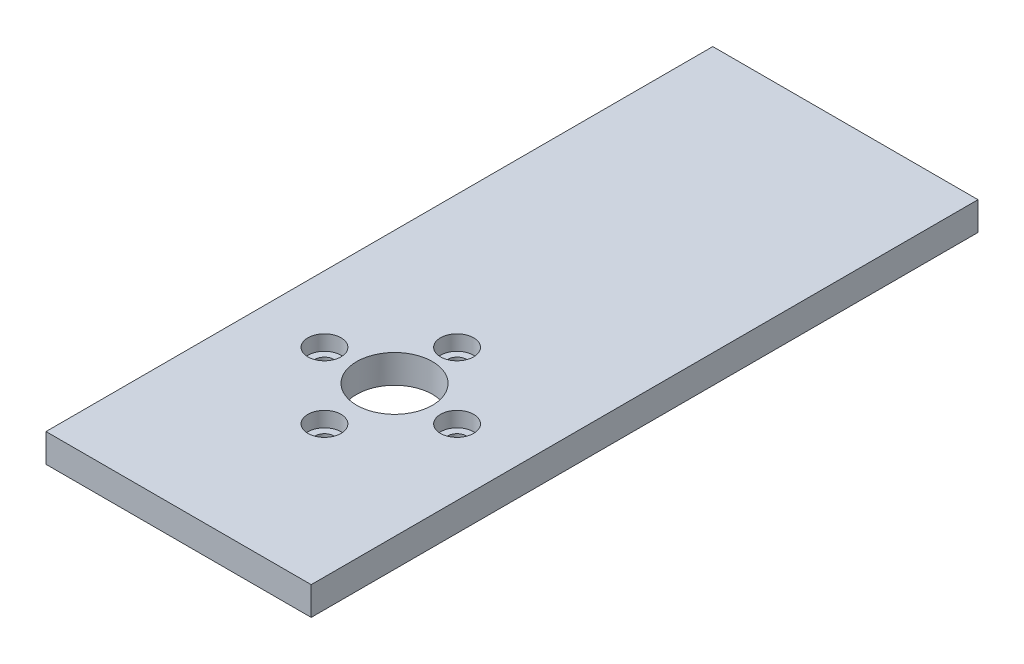
ISO-10303-21;
HEADER;
FILE_DESCRIPTION(('STEP AP214'),'2;1');
FILE_NAME('part.step','',(''),(''),'','','');
FILE_SCHEMA(('AUTOMOTIVE_DESIGN { 1 0 10303 214 1 1 1 1 }'));
ENDSEC;
DATA;
#1=APPLICATION_CONTEXT('core data for automotive mechanical design processes');
#2=APPLICATION_PROTOCOL_DEFINITION('international standard','automotive_design',2000,#1);
#3=PRODUCT_CONTEXT('',#1,'mechanical');
#4=PRODUCT('Part','Part','',(#3));
#5=PRODUCT_RELATED_PRODUCT_CATEGORY('part','',(#4));
#6=PRODUCT_DEFINITION_FORMATION('','',#4);
#7=PRODUCT_DEFINITION_CONTEXT('part definition',#1,'design');
#8=PRODUCT_DEFINITION('design','',#6,#7);
#9=PRODUCT_DEFINITION_SHAPE('','',#8);
#10=(LENGTH_UNIT() NAMED_UNIT(*) SI_UNIT(.MILLI.,.METRE.));
#11=(NAMED_UNIT(*) PLANE_ANGLE_UNIT() SI_UNIT($,.RADIAN.));
#12=(NAMED_UNIT(*) SI_UNIT($,.STERADIAN.) SOLID_ANGLE_UNIT());
#13=UNCERTAINTY_MEASURE_WITH_UNIT(LENGTH_MEASURE(1.E-05),#10,'distance_accuracy_value','');
#14=(GEOMETRIC_REPRESENTATION_CONTEXT(3) GLOBAL_UNCERTAINTY_ASSIGNED_CONTEXT((#13)) GLOBAL_UNIT_ASSIGNED_CONTEXT((#10,
#11,#12)) REPRESENTATION_CONTEXT('',''));
#15=CARTESIAN_POINT('',(0.,0.,0.));
#16=DIRECTION('',(0.,0.,1.));
#17=DIRECTION('',(1.,0.,0.));
#18=AXIS2_PLACEMENT_3D('',#15,#16,#17);
#19=CARTESIAN_POINT('',(7.0000000000001,-7.,12.7999999999978));
#20=DIRECTION('',(0.,1.,0.));
#21=DIRECTION('',(0.,0.,1.));
#22=AXIS2_PLACEMENT_3D('',#19,#20,#21);
#23=CYLINDRICAL_SURFACE('',#22,1.);
#24=CARTESIAN_POINT('',(7.0000000000001,0.,12.7999999999978));
#25=DIRECTION('',(0.,-1.,0.));
#26=DIRECTION('',(0.,0.,-1.));
#27=AXIS2_PLACEMENT_3D('',#24,#25,#26);
#28=CIRCLE('',#27,1.);
#29=CARTESIAN_POINT('',(7.0000000000001,0.,11.7999999999978));
#30=VERTEX_POINT('',#29);
#31=EDGE_CURVE('E115',#30,#30,#28,.T.);
#32=ORIENTED_EDGE('',*,*,#31,.T.);
#33=EDGE_LOOP('',(#32));
#34=FACE_BOUND('',#33,.T.);
#35=CARTESIAN_POINT('',(7.0000000000001,1.4,12.7999999999978));
#36=DIRECTION('',(0.,1.,0.));
#37=DIRECTION('',(0.,0.,1.));
#38=AXIS2_PLACEMENT_3D('',#35,#36,#37);
#39=CIRCLE('',#38,1.);
#40=CARTESIAN_POINT('',(7.0000000000001,1.4,13.7999999999978));
#41=VERTEX_POINT('',#40);
#42=EDGE_CURVE('E41',#41,#41,#39,.F.);
#43=ORIENTED_EDGE('',*,*,#42,.F.);
#44=EDGE_LOOP('',(#43));
#45=FACE_BOUND('',#44,.T.);
#46=ADVANCED_FACE('F37',(#34,#45),#23,.F.);
#47=CARTESIAN_POINT('',(-6.9999999999999,-7.,12.7999999999979));
#48=DIRECTION('',(0.,1.,0.));
#49=DIRECTION('',(0.,0.,1.));
#50=AXIS2_PLACEMENT_3D('',#47,#48,#49);
#51=CYLINDRICAL_SURFACE('',#50,1.);
#52=CARTESIAN_POINT('',(-6.9999999999999,0.,12.7999999999979));
#53=DIRECTION('',(0.,-1.,0.));
#54=DIRECTION('',(0.,0.,-1.));
#55=AXIS2_PLACEMENT_3D('',#52,#53,#54);
#56=CIRCLE('',#55,1.);
#57=CARTESIAN_POINT('',(-6.9999999999999,0.,11.7999999999979));
#58=VERTEX_POINT('',#57);
#59=EDGE_CURVE('E121',#58,#58,#56,.T.);
#60=ORIENTED_EDGE('',*,*,#59,.T.);
#61=EDGE_LOOP('',(#60));
#62=FACE_BOUND('',#61,.T.);
#63=CARTESIAN_POINT('',(-6.9999999999999,1.4,12.7999999999979));
#64=DIRECTION('',(0.,1.,0.));
#65=DIRECTION('',(0.,0.,1.));
#66=AXIS2_PLACEMENT_3D('',#63,#64,#65);
#67=CIRCLE('',#66,1.);
#68=CARTESIAN_POINT('',(-6.9999999999999,1.4,13.7999999999979));
#69=VERTEX_POINT('',#68);
#70=EDGE_CURVE('E136',#69,#69,#67,.F.);
#71=ORIENTED_EDGE('',*,*,#70,.F.);
#72=EDGE_LOOP('',(#71));
#73=FACE_BOUND('',#72,.T.);
#74=ADVANCED_FACE('F182',(#62,#73),#51,.F.);
#75=CARTESIAN_POINT('',(0.,-7.,5.79999999999792));
#76=DIRECTION('',(0.,1.,0.));
#77=DIRECTION('',(0.,0.,1.));
#78=AXIS2_PLACEMENT_3D('',#75,#76,#77);
#79=CYLINDRICAL_SURFACE('',#78,1.);
#80=CARTESIAN_POINT('',(0.,0.,5.79999999999792));
#81=DIRECTION('',(0.,-1.,0.));
#82=DIRECTION('',(0.,0.,-1.));
#83=AXIS2_PLACEMENT_3D('',#80,#81,#82);
#84=CIRCLE('',#83,1.);
#85=CARTESIAN_POINT('',(0.,0.,4.79999999999792));
#86=VERTEX_POINT('',#85);
#87=EDGE_CURVE('E107',#86,#86,#84,.T.);
#88=ORIENTED_EDGE('',*,*,#87,.T.);
#89=EDGE_LOOP('',(#88));
#90=FACE_BOUND('',#89,.T.);
#91=CARTESIAN_POINT('',(0.,1.4,5.79999999999792));
#92=DIRECTION('',(0.,1.,0.));
#93=DIRECTION('',(0.,0.,1.));
#94=AXIS2_PLACEMENT_3D('',#91,#92,#93);
#95=CIRCLE('',#94,1.);
#96=CARTESIAN_POINT('',(0.,1.4,6.79999999999792));
#97=VERTEX_POINT('',#96);
#98=EDGE_CURVE('E132',#97,#97,#95,.F.);
#99=ORIENTED_EDGE('',*,*,#98,.F.);
#100=EDGE_LOOP('',(#99));
#101=FACE_BOUND('',#100,.T.);
#102=ADVANCED_FACE('F188',(#90,#101),#79,.F.);
#103=CARTESIAN_POINT('',(1.45764745514838E-13,-7.,19.7999999999979));
#104=DIRECTION('',(0.,1.,0.));
#105=DIRECTION('',(0.,0.,1.));
#106=AXIS2_PLACEMENT_3D('',#103,#104,#105);
#107=CYLINDRICAL_SURFACE('',#106,1.);
#108=CARTESIAN_POINT('',(1.45764745514838E-13,0.,19.7999999999979));
#109=DIRECTION('',(0.,-1.,0.));
#110=DIRECTION('',(0.,0.,-1.));
#111=AXIS2_PLACEMENT_3D('',#108,#109,#110);
#112=CIRCLE('',#111,1.);
#113=CARTESIAN_POINT('',(1.45764745514838E-13,0.,18.7999999999979));
#114=VERTEX_POINT('',#113);
#115=EDGE_CURVE('E118',#114,#114,#112,.T.);
#116=ORIENTED_EDGE('',*,*,#115,.T.);
#117=EDGE_LOOP('',(#116));
#118=FACE_BOUND('',#117,.T.);
#119=CARTESIAN_POINT('',(1.45764745514838E-13,1.4,19.7999999999979));
#120=DIRECTION('',(0.,1.,0.));
#121=DIRECTION('',(0.,0.,1.));
#122=AXIS2_PLACEMENT_3D('',#119,#120,#121);
#123=CIRCLE('',#122,1.);
#124=CARTESIAN_POINT('',(1.45764745514838E-13,1.4,20.7999999999979));
#125=VERTEX_POINT('',#124);
#126=EDGE_CURVE('E128',#125,#125,#123,.F.);
#127=ORIENTED_EDGE('',*,*,#126,.F.);
#128=EDGE_LOOP('',(#127));
#129=FACE_BOUND('',#128,.T.);
#130=ADVANCED_FACE('F193',(#118,#129),#107,.F.);
#131=CARTESIAN_POINT('',(14.,3.,35.2));
#132=DIRECTION('',(-1.,0.,0.));
#133=DIRECTION('',(0.,0.,1.));
#134=AXIS2_PLACEMENT_3D('',#131,#132,#133);
#135=PLANE('',#134);
#136=DIRECTION('',(0.,0.,-1.));
#137=VECTOR('',#136,1.);
#138=CARTESIAN_POINT('',(14.,0.,35.2));
#139=LINE('',#138,#137);
#140=CARTESIAN_POINT('',(14.,0.,35.2));
#141=VERTEX_POINT('',#140);
#142=CARTESIAN_POINT('',(14.,0.,-35.2));
#143=VERTEX_POINT('',#142);
#144=EDGE_CURVE('E104',#141,#143,#139,.T.);
#145=ORIENTED_EDGE('',*,*,#144,.T.);
#146=DIRECTION('',(0.,-1.,0.));
#147=VECTOR('',#146,1.);
#148=CARTESIAN_POINT('',(14.,3.,-35.2));
#149=LINE('',#148,#147);
#150=CARTESIAN_POINT('',(14.,3.,-35.2));
#151=VERTEX_POINT('',#150);
#152=EDGE_CURVE('E11',#151,#143,#149,.T.);
#153=ORIENTED_EDGE('',*,*,#152,.F.);
#154=DIRECTION('',(0.,0.,-1.));
#155=VECTOR('',#154,1.);
#156=CARTESIAN_POINT('',(14.,3.,35.2));
#157=LINE('',#156,#155);
#158=CARTESIAN_POINT('',(14.,3.,35.2));
#159=VERTEX_POINT('',#158);
#160=EDGE_CURVE('E91',#159,#151,#157,.T.);
#161=ORIENTED_EDGE('',*,*,#160,.F.);
#162=DIRECTION('',(0.,-1.,0.));
#163=VECTOR('',#162,1.);
#164=CARTESIAN_POINT('',(14.,3.,35.2));
#165=LINE('',#164,#163);
#166=EDGE_CURVE('E100',#159,#141,#165,.T.);
#167=ORIENTED_EDGE('',*,*,#166,.T.);
#168=EDGE_LOOP('',(#145,#153,#161,#167));
#169=FACE_BOUND('',#168,.T.);
#170=ADVANCED_FACE('F39',(#169),#135,.F.);
#171=CARTESIAN_POINT('',(-14.,3.,-35.2));
#172=DIRECTION('',(0.,0.,1.));
#173=DIRECTION('',(1.,0.,0.));
#174=AXIS2_PLACEMENT_3D('',#171,#172,#173);
#175=PLANE('',#174);
#176=DIRECTION('',(-1.,0.,0.));
#177=VECTOR('',#176,1.);
#178=CARTESIAN_POINT('',(-14.,0.,-35.2));
#179=LINE('',#178,#177);
#180=CARTESIAN_POINT('',(-14.,0.,-35.2));
#181=VERTEX_POINT('',#180);
#182=EDGE_CURVE('E95',#143,#181,#179,.T.);
#183=ORIENTED_EDGE('',*,*,#182,.T.);
#184=DIRECTION('',(0.,-1.,0.));
#185=VECTOR('',#184,1.);
#186=CARTESIAN_POINT('',(-14.,3.,-35.2));
#187=LINE('',#186,#185);
#188=CARTESIAN_POINT('',(-14.,3.,-35.2));
#189=VERTEX_POINT('',#188);
#190=EDGE_CURVE('E47',#189,#181,#187,.T.);
#191=ORIENTED_EDGE('',*,*,#190,.F.);
#192=DIRECTION('',(-1.,0.,0.));
#193=VECTOR('',#192,1.);
#194=CARTESIAN_POINT('',(-14.,3.,-35.2));
#195=LINE('',#194,#193);
#196=EDGE_CURVE('E86',#151,#189,#195,.T.);
#197=ORIENTED_EDGE('',*,*,#196,.F.);
#198=ORIENTED_EDGE('',*,*,#152,.T.);
#199=EDGE_LOOP('',(#183,#191,#197,#198));
#200=FACE_BOUND('',#199,.T.);
#201=ADVANCED_FACE('F94',(#200),#175,.F.);
#202=CARTESIAN_POINT('',(-14.,3.,35.2));
#203=DIRECTION('',(1.,0.,0.));
#204=DIRECTION('',(0.,0.,-1.));
#205=AXIS2_PLACEMENT_3D('',#202,#203,#204);
#206=PLANE('',#205);
#207=DIRECTION('',(0.,0.,1.));
#208=VECTOR('',#207,1.);
#209=CARTESIAN_POINT('',(-14.,0.,35.2));
#210=LINE('',#209,#208);
#211=CARTESIAN_POINT('',(-14.,0.,35.2));
#212=VERTEX_POINT('',#211);
#213=EDGE_CURVE('E73',#181,#212,#210,.T.);
#214=ORIENTED_EDGE('',*,*,#213,.T.);
#215=DIRECTION('',(0.,-1.,0.));
#216=VECTOR('',#215,1.);
#217=CARTESIAN_POINT('',(-14.,3.,35.2));
#218=LINE('',#217,#216);
#219=CARTESIAN_POINT('',(-14.,3.,35.2));
#220=VERTEX_POINT('',#219);
#221=EDGE_CURVE('E96',#220,#212,#218,.T.);
#222=ORIENTED_EDGE('',*,*,#221,.F.);
#223=DIRECTION('',(0.,0.,1.));
#224=VECTOR('',#223,1.);
#225=CARTESIAN_POINT('',(-14.,3.,35.2));
#226=LINE('',#225,#224);
#227=EDGE_CURVE('E89',#189,#220,#226,.T.);
#228=ORIENTED_EDGE('',*,*,#227,.F.);
#229=ORIENTED_EDGE('',*,*,#190,.T.);
#230=EDGE_LOOP('',(#214,#222,#228,#229));
#231=FACE_BOUND('',#230,.T.);
#232=ADVANCED_FACE('F98',(#231),#206,.F.);
#233=CARTESIAN_POINT('',(-14.,3.,35.2));
#234=DIRECTION('',(0.,0.,-1.));
#235=DIRECTION('',(-1.,0.,0.));
#236=AXIS2_PLACEMENT_3D('',#233,#234,#235);
#237=PLANE('',#236);
#238=DIRECTION('',(1.,0.,0.));
#239=VECTOR('',#238,1.);
#240=CARTESIAN_POINT('',(-14.,0.,35.2));
#241=LINE('',#240,#239);
#242=EDGE_CURVE('E79',#212,#141,#241,.T.);
#243=ORIENTED_EDGE('',*,*,#242,.T.);
#244=ORIENTED_EDGE('',*,*,#166,.F.);
#245=DIRECTION('',(1.,0.,0.));
#246=VECTOR('',#245,1.);
#247=CARTESIAN_POINT('',(-14.,3.,35.2));
#248=LINE('',#247,#246);
#249=EDGE_CURVE('E56',#220,#159,#248,.T.);
#250=ORIENTED_EDGE('',*,*,#249,.F.);
#251=ORIENTED_EDGE('',*,*,#221,.T.);
#252=EDGE_LOOP('',(#243,#244,#250,#251));
#253=FACE_BOUND('',#252,.T.);
#254=ADVANCED_FACE('F168',(#253),#237,.F.);
#255=CARTESIAN_POINT('',(0.,3.,0.));
#256=DIRECTION('',(0.,-1.,0.));
#257=DIRECTION('',(0.,0.,-1.));
#258=AXIS2_PLACEMENT_3D('',#255,#256,#257);
#259=PLANE('',#258);
#260=CARTESIAN_POINT('',(7.0000000000001,3.,12.7999999999978));
#261=DIRECTION('',(0.,1.,0.));
#262=DIRECTION('',(0.,0.,1.));
#263=AXIS2_PLACEMENT_3D('',#260,#261,#262);
#264=CIRCLE('',#263,1.75);
#265=CARTESIAN_POINT('',(7.0000000000001,3.,14.5499999999978));
#266=VERTEX_POINT('',#265);
#267=EDGE_CURVE('E152',#266,#266,#264,.T.);
#268=ORIENTED_EDGE('',*,*,#267,.F.);
#269=EDGE_LOOP('',(#268));
#270=FACE_BOUND('',#269,.T.);
#271=CARTESIAN_POINT('',(-6.9999999999999,3.,12.7999999999979));
#272=DIRECTION('',(0.,1.,0.));
#273=DIRECTION('',(0.,0.,1.));
#274=AXIS2_PLACEMENT_3D('',#271,#272,#273);
#275=CIRCLE('',#274,1.75);
#276=CARTESIAN_POINT('',(-6.9999999999999,3.,14.5499999999979));
#277=VERTEX_POINT('',#276);
#278=EDGE_CURVE('E145',#277,#277,#275,.T.);
#279=ORIENTED_EDGE('',*,*,#278,.F.);
#280=EDGE_LOOP('',(#279));
#281=FACE_BOUND('',#280,.T.);
#282=CARTESIAN_POINT('',(0.,3.,5.79999999999792));
#283=DIRECTION('',(0.,1.,0.));
#284=DIRECTION('',(0.,0.,1.));
#285=AXIS2_PLACEMENT_3D('',#282,#283,#284);
#286=CIRCLE('',#285,1.75);
#287=CARTESIAN_POINT('',(0.,3.,7.54999999999792));
#288=VERTEX_POINT('',#287);
#289=EDGE_CURVE('E138',#288,#288,#286,.T.);
#290=ORIENTED_EDGE('',*,*,#289,.F.);
#291=EDGE_LOOP('',(#290));
#292=FACE_BOUND('',#291,.T.);
#293=CARTESIAN_POINT('',(1.45764745514838E-13,3.,19.7999999999979));
#294=DIRECTION('',(0.,1.,0.));
#295=DIRECTION('',(0.,0.,1.));
#296=AXIS2_PLACEMENT_3D('',#293,#294,#295);
#297=CIRCLE('',#296,1.75);
#298=CARTESIAN_POINT('',(1.45764745514838E-13,3.,21.5499999999979));
#299=VERTEX_POINT('',#298);
#300=EDGE_CURVE('E134',#299,#299,#297,.T.);
#301=ORIENTED_EDGE('',*,*,#300,.F.);
#302=EDGE_LOOP('',(#301));
#303=FACE_BOUND('',#302,.T.);
#304=CARTESIAN_POINT('',(0.,3.,12.3999999999985));
#305=DIRECTION('',(0.,1.,0.));
#306=DIRECTION('',(0.,0.,1.));
#307=AXIS2_PLACEMENT_3D('',#304,#305,#306);
#308=CIRCLE('',#307,4.);
#309=CARTESIAN_POINT('',(0.,3.,16.3999999999985));
#310=VERTEX_POINT('',#309);
#311=EDGE_CURVE('E127',#310,#310,#308,.T.);
#312=ORIENTED_EDGE('',*,*,#311,.F.);
#313=EDGE_LOOP('',(#312));
#314=FACE_BOUND('',#313,.T.);
#315=ORIENTED_EDGE('',*,*,#160,.T.);
#316=ORIENTED_EDGE('',*,*,#196,.T.);
#317=ORIENTED_EDGE('',*,*,#227,.T.);
#318=ORIENTED_EDGE('',*,*,#249,.T.);
#319=EDGE_LOOP('',(#315,#316,#317,#318));
#320=FACE_BOUND('',#319,.T.);
#321=ADVANCED_FACE('F87',(#270,#281,#292,#303,#314,#320),#259,.F.);
#322=CARTESIAN_POINT('',(0.,0.,0.));
#323=DIRECTION('',(0.,-1.,0.));
#324=DIRECTION('',(0.,0.,-1.));
#325=AXIS2_PLACEMENT_3D('',#322,#323,#324);
#326=PLANE('',#325);
#327=CARTESIAN_POINT('',(0.,0.,12.3999999999985));
#328=DIRECTION('',(0.,-1.,0.));
#329=DIRECTION('',(0.,0.,-1.));
#330=AXIS2_PLACEMENT_3D('',#327,#328,#329);
#331=CIRCLE('',#330,4.);
#332=CARTESIAN_POINT('',(0.,0.,8.39999999999852));
#333=VERTEX_POINT('',#332);
#334=EDGE_CURVE('E124',#333,#333,#331,.T.);
#335=ORIENTED_EDGE('',*,*,#334,.F.);
#336=EDGE_LOOP('',(#335));
#337=FACE_BOUND('',#336,.T.);
#338=ORIENTED_EDGE('',*,*,#59,.F.);
#339=EDGE_LOOP('',(#338));
#340=FACE_BOUND('',#339,.T.);
#341=ORIENTED_EDGE('',*,*,#115,.F.);
#342=EDGE_LOOP('',(#341));
#343=FACE_BOUND('',#342,.T.);
#344=ORIENTED_EDGE('',*,*,#31,.F.);
#345=EDGE_LOOP('',(#344));
#346=FACE_BOUND('',#345,.T.);
#347=ORIENTED_EDGE('',*,*,#87,.F.);
#348=EDGE_LOOP('',(#347));
#349=FACE_BOUND('',#348,.T.);
#350=ORIENTED_EDGE('',*,*,#144,.F.);
#351=ORIENTED_EDGE('',*,*,#242,.F.);
#352=ORIENTED_EDGE('',*,*,#213,.F.);
#353=ORIENTED_EDGE('',*,*,#182,.F.);
#354=EDGE_LOOP('',(#350,#351,#352,#353));
#355=FACE_BOUND('',#354,.T.);
#356=ADVANCED_FACE('F167',(#337,#340,#343,#346,#349,#355),#326,.T.);
#357=CARTESIAN_POINT('',(0.,-7.,12.3999999999985));
#358=DIRECTION('',(0.,1.,0.));
#359=DIRECTION('',(0.,0.,1.));
#360=AXIS2_PLACEMENT_3D('',#357,#358,#359);
#361=CYLINDRICAL_SURFACE('',#360,4.);
#362=ORIENTED_EDGE('',*,*,#334,.T.);
#363=EDGE_LOOP('',(#362));
#364=FACE_BOUND('',#363,.T.);
#365=ORIENTED_EDGE('',*,*,#311,.T.);
#366=EDGE_LOOP('',(#365));
#367=FACE_BOUND('',#366,.T.);
#368=ADVANCED_FACE('F164',(#364,#367),#361,.F.);
#369=CARTESIAN_POINT('',(1.45764745514838E-13,1.4,19.7999999999979));
#370=DIRECTION('',(0.,1.,0.));
#371=DIRECTION('',(0.,0.,1.));
#372=AXIS2_PLACEMENT_3D('',#369,#370,#371);
#373=PLANE('',#372);
#374=CARTESIAN_POINT('',(1.45764745514838E-13,1.4,19.7999999999979));
#375=DIRECTION('',(0.,1.,0.));
#376=DIRECTION('',(0.,0.,1.));
#377=AXIS2_PLACEMENT_3D('',#374,#375,#376);
#378=CIRCLE('',#377,1.75);
#379=CARTESIAN_POINT('',(1.45764745514838E-13,1.4,21.5499999999979));
#380=VERTEX_POINT('',#379);
#381=EDGE_CURVE('E131',#380,#380,#378,.T.);
#382=ORIENTED_EDGE('',*,*,#381,.T.);
#383=EDGE_LOOP('',(#382));
#384=FACE_BOUND('',#383,.T.);
#385=ORIENTED_EDGE('',*,*,#126,.T.);
#386=EDGE_LOOP('',(#385));
#387=FACE_BOUND('',#386,.T.);
#388=ADVANCED_FACE('F217',(#384,#387),#373,.T.);
#389=CARTESIAN_POINT('',(1.45764745514838E-13,1.4,19.7999999999979));
#390=DIRECTION('',(0.,1.,0.));
#391=DIRECTION('',(0.,0.,1.));
#392=AXIS2_PLACEMENT_3D('',#389,#390,#391);
#393=CYLINDRICAL_SURFACE('',#392,1.75);
#394=ORIENTED_EDGE('',*,*,#381,.F.);
#395=EDGE_LOOP('',(#394));
#396=FACE_BOUND('',#395,.T.);
#397=ORIENTED_EDGE('',*,*,#300,.T.);
#398=EDGE_LOOP('',(#397));
#399=FACE_BOUND('',#398,.T.);
#400=ADVANCED_FACE('F207',(#396,#399),#393,.F.);
#401=CARTESIAN_POINT('',(0.,1.4,5.79999999999792));
#402=DIRECTION('',(0.,1.,0.));
#403=DIRECTION('',(0.,0.,1.));
#404=AXIS2_PLACEMENT_3D('',#401,#402,#403);
#405=PLANE('',#404);
#406=CARTESIAN_POINT('',(0.,1.4,5.79999999999792));
#407=DIRECTION('',(0.,1.,0.));
#408=DIRECTION('',(0.,0.,1.));
#409=AXIS2_PLACEMENT_3D('',#406,#407,#408);
#410=CIRCLE('',#409,1.75);
#411=CARTESIAN_POINT('',(0.,1.4,7.54999999999792));
#412=VERTEX_POINT('',#411);
#413=EDGE_CURVE('E135',#412,#412,#410,.T.);
#414=ORIENTED_EDGE('',*,*,#413,.T.);
#415=EDGE_LOOP('',(#414));
#416=FACE_BOUND('',#415,.T.);
#417=ORIENTED_EDGE('',*,*,#98,.T.);
#418=EDGE_LOOP('',(#417));
#419=FACE_BOUND('',#418,.T.);
#420=ADVANCED_FACE('F204',(#416,#419),#405,.T.);
#421=CARTESIAN_POINT('',(0.,1.4,5.79999999999792));
#422=DIRECTION('',(0.,1.,0.));
#423=DIRECTION('',(0.,0.,1.));
#424=AXIS2_PLACEMENT_3D('',#421,#422,#423);
#425=CYLINDRICAL_SURFACE('',#424,1.75);
#426=ORIENTED_EDGE('',*,*,#413,.F.);
#427=EDGE_LOOP('',(#426));
#428=FACE_BOUND('',#427,.T.);
#429=ORIENTED_EDGE('',*,*,#289,.T.);
#430=EDGE_LOOP('',(#429));
#431=FACE_BOUND('',#430,.T.);
#432=ADVANCED_FACE('F206',(#428,#431),#425,.F.);
#433=CARTESIAN_POINT('',(-6.9999999999999,1.4,12.7999999999979));
#434=DIRECTION('',(0.,1.,0.));
#435=DIRECTION('',(0.,0.,1.));
#436=AXIS2_PLACEMENT_3D('',#433,#434,#435);
#437=PLANE('',#436);
#438=CARTESIAN_POINT('',(-6.9999999999999,1.4,12.7999999999979));
#439=DIRECTION('',(0.,1.,0.));
#440=DIRECTION('',(0.,0.,1.));
#441=AXIS2_PLACEMENT_3D('',#438,#439,#440);
#442=CIRCLE('',#441,1.75);
#443=CARTESIAN_POINT('',(-6.9999999999999,1.4,14.5499999999979));
#444=VERTEX_POINT('',#443);
#445=EDGE_CURVE('E139',#444,#444,#442,.T.);
#446=ORIENTED_EDGE('',*,*,#445,.T.);
#447=EDGE_LOOP('',(#446));
#448=FACE_BOUND('',#447,.T.);
#449=ORIENTED_EDGE('',*,*,#70,.T.);
#450=EDGE_LOOP('',(#449));
#451=FACE_BOUND('',#450,.T.);
#452=ADVANCED_FACE('F214',(#448,#451),#437,.T.);
#453=CARTESIAN_POINT('',(-6.9999999999999,1.4,12.7999999999979));
#454=DIRECTION('',(0.,1.,0.));
#455=DIRECTION('',(0.,0.,1.));
#456=AXIS2_PLACEMENT_3D('',#453,#454,#455);
#457=CYLINDRICAL_SURFACE('',#456,1.75);
#458=ORIENTED_EDGE('',*,*,#445,.F.);
#459=EDGE_LOOP('',(#458));
#460=FACE_BOUND('',#459,.T.);
#461=ORIENTED_EDGE('',*,*,#278,.T.);
#462=EDGE_LOOP('',(#461));
#463=FACE_BOUND('',#462,.T.);
#464=ADVANCED_FACE('F221',(#460,#463),#457,.F.);
#465=CARTESIAN_POINT('',(7.0000000000001,1.4,12.7999999999978));
#466=DIRECTION('',(0.,1.,0.));
#467=DIRECTION('',(0.,0.,1.));
#468=AXIS2_PLACEMENT_3D('',#465,#466,#467);
#469=PLANE('',#468);
#470=CARTESIAN_POINT('',(7.0000000000001,1.4,12.7999999999978));
#471=DIRECTION('',(0.,1.,0.));
#472=DIRECTION('',(0.,0.,1.));
#473=AXIS2_PLACEMENT_3D('',#470,#471,#472);
#474=CIRCLE('',#473,1.75);
#475=CARTESIAN_POINT('',(7.0000000000001,1.4,14.5499999999978));
#476=VERTEX_POINT('',#475);
#477=EDGE_CURVE('E354',#476,#476,#474,.T.);
#478=ORIENTED_EDGE('',*,*,#477,.T.);
#479=EDGE_LOOP('',(#478));
#480=FACE_BOUND('',#479,.T.);
#481=ORIENTED_EDGE('',*,*,#42,.T.);
#482=EDGE_LOOP('',(#481));
#483=FACE_BOUND('',#482,.T.);
#484=ADVANCED_FACE('F328',(#480,#483),#469,.T.);
#485=CARTESIAN_POINT('',(7.0000000000001,1.4,12.7999999999978));
#486=DIRECTION('',(0.,1.,0.));
#487=DIRECTION('',(0.,0.,1.));
#488=AXIS2_PLACEMENT_3D('',#485,#486,#487);
#489=CYLINDRICAL_SURFACE('',#488,1.75);
#490=ORIENTED_EDGE('',*,*,#477,.F.);
#491=EDGE_LOOP('',(#490));
#492=FACE_BOUND('',#491,.T.);
#493=ORIENTED_EDGE('',*,*,#267,.T.);
#494=EDGE_LOOP('',(#493));
#495=FACE_BOUND('',#494,.T.);
#496=ADVANCED_FACE('F337',(#492,#495),#489,.F.);
#497=CLOSED_SHELL('',(#46,#74,#102,#130,#170,#201,#232,#254,#321,#356,#368,#388,#400,#420,#432,
#452,#464,#484,#496));
#498=MANIFOLD_SOLID_BREP('B2',#497);
#499=ADVANCED_BREP_SHAPE_REPRESENTATION('',(#18,#498),#14);
#500=SHAPE_DEFINITION_REPRESENTATION(#9,#499);
ENDSEC;
END-ISO-10303-21;
